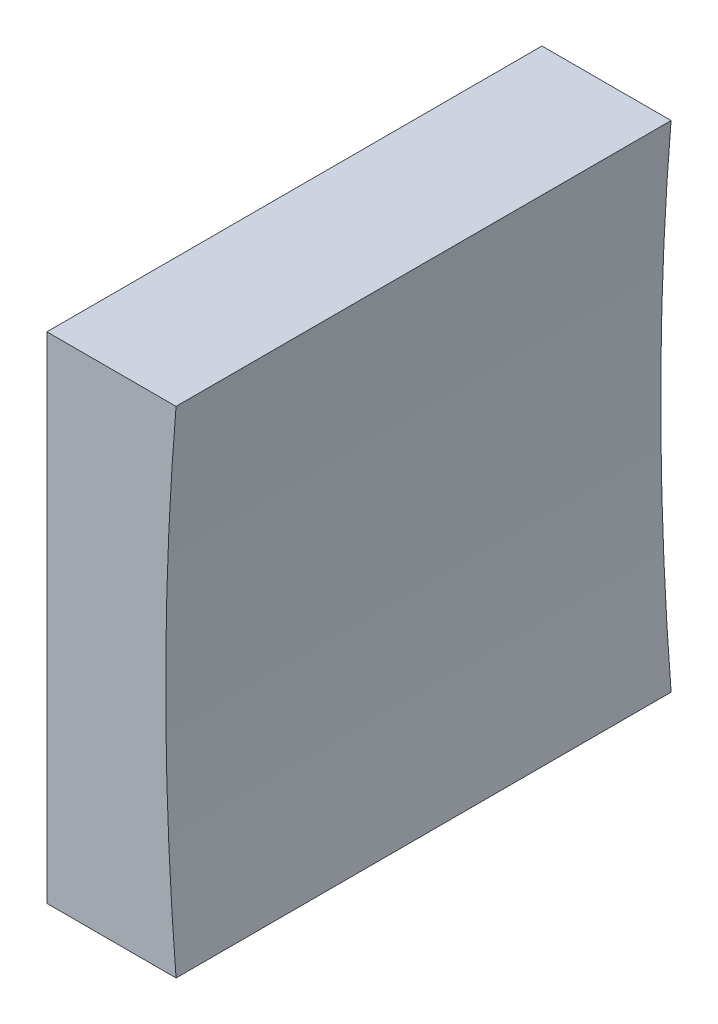
ISO-10303-21;
HEADER;
FILE_DESCRIPTION(('STEP AP214'),'2;1');
FILE_NAME('part.step','',(''),(''),'','','');
FILE_SCHEMA(('AUTOMOTIVE_DESIGN { 1 0 10303 214 1 1 1 1 }'));
ENDSEC;
DATA;
#1=APPLICATION_CONTEXT('core data for automotive mechanical design processes');
#2=APPLICATION_PROTOCOL_DEFINITION('international standard','automotive_design',2000,#1);
#3=PRODUCT_CONTEXT('',#1,'mechanical');
#4=PRODUCT('Part','Part','',(#3));
#5=PRODUCT_RELATED_PRODUCT_CATEGORY('part','',(#4));
#6=PRODUCT_DEFINITION_FORMATION('','',#4);
#7=PRODUCT_DEFINITION_CONTEXT('part definition',#1,'design');
#8=PRODUCT_DEFINITION('design','',#6,#7);
#9=PRODUCT_DEFINITION_SHAPE('','',#8);
#10=(LENGTH_UNIT() NAMED_UNIT(*) SI_UNIT(.MILLI.,.METRE.));
#11=(NAMED_UNIT(*) PLANE_ANGLE_UNIT() SI_UNIT($,.RADIAN.));
#12=(NAMED_UNIT(*) SI_UNIT($,.STERADIAN.) SOLID_ANGLE_UNIT());
#13=UNCERTAINTY_MEASURE_WITH_UNIT(LENGTH_MEASURE(1.E-05),#10,'distance_accuracy_value','');
#14=(GEOMETRIC_REPRESENTATION_CONTEXT(3) GLOBAL_UNCERTAINTY_ASSIGNED_CONTEXT((#13)) GLOBAL_UNIT_ASSIGNED_CONTEXT((#10,
#11,#12)) REPRESENTATION_CONTEXT('',''));
#15=CARTESIAN_POINT('',(0.,0.,0.));
#16=DIRECTION('',(0.,0.,1.));
#17=DIRECTION('',(1.,0.,0.));
#18=AXIS2_PLACEMENT_3D('',#15,#16,#17);
#19=CARTESIAN_POINT('',(291.228876342537,54.3579292677671,25.));
#20=DIRECTION('',(0.,1.,0.));
#21=DIRECTION('',(0.,0.,1.));
#22=AXIS2_PLACEMENT_3D('',#19,#20,#21);
#23=PLANE('',#22);
#24=DIRECTION('',(1.,0.,0.));
#25=VECTOR('',#24,1.);
#26=CARTESIAN_POINT('',(291.228876342537,54.3579292677671,0.));
#27=LINE('',#26,#25);
#28=CARTESIAN_POINT('',(284.707135631282,54.3579292677671,0.));
#29=VERTEX_POINT('',#28);
#30=CARTESIAN_POINT('',(291.228876342537,54.3579292677671,0.));
#31=VERTEX_POINT('',#30);
#32=EDGE_CURVE('E91',#29,#31,#27,.T.);
#33=ORIENTED_EDGE('',*,*,#32,.T.);
#34=DIRECTION('',(0.,0.,-1.));
#35=VECTOR('',#34,1.);
#36=CARTESIAN_POINT('',(291.228876342537,54.3579292677671,25.));
#37=LINE('',#36,#35);
#38=CARTESIAN_POINT('',(291.228876342537,54.3579292677671,25.));
#39=VERTEX_POINT('',#38);
#40=EDGE_CURVE('E45',#39,#31,#37,.T.);
#41=ORIENTED_EDGE('',*,*,#40,.F.);
#42=DIRECTION('',(1.,0.,0.));
#43=VECTOR('',#42,1.);
#44=CARTESIAN_POINT('',(291.228876342537,54.3579292677671,25.));
#45=LINE('',#44,#43);
#46=CARTESIAN_POINT('',(284.707135631282,54.3579292677671,25.));
#47=VERTEX_POINT('',#46);
#48=EDGE_CURVE('E84',#47,#39,#45,.T.);
#49=ORIENTED_EDGE('',*,*,#48,.F.);
#50=DIRECTION('',(0.,0.,-1.));
#51=VECTOR('',#50,1.);
#52=CARTESIAN_POINT('',(284.707135631282,54.3579292677671,25.));
#53=LINE('',#52,#51);
#54=EDGE_CURVE('E11',#47,#29,#53,.T.);
#55=ORIENTED_EDGE('',*,*,#54,.T.);
#56=EDGE_LOOP('',(#33,#41,#49,#55));
#57=FACE_BOUND('',#56,.T.);
#58=ADVANCED_FACE('F37',(#57),#23,.F.);
#59=CARTESIAN_POINT('',(440.707135631304,66.8579292677671,25.));
#60=DIRECTION('',(0.,0.,-1.));
#61=DIRECTION('',(-1.,0.,0.));
#62=AXIS2_PLACEMENT_3D('',#59,#60,#61);
#63=CYLINDRICAL_SURFACE('',#62,150.);
#64=CARTESIAN_POINT('',(440.707135631304,66.8579292677671,0.));
#65=DIRECTION('',(0.,0.,-1.));
#66=DIRECTION('',(1.,0.,0.));
#67=AXIS2_PLACEMENT_3D('',#64,#65,#66);
#68=CIRCLE('',#67,150.);
#69=CARTESIAN_POINT('',(291.228876342537,79.3579292677671,0.));
#70=VERTEX_POINT('',#69);
#71=EDGE_CURVE('E71',#31,#70,#68,.T.);
#72=ORIENTED_EDGE('',*,*,#71,.T.);
#73=DIRECTION('',(0.,0.,-1.));
#74=VECTOR('',#73,1.);
#75=CARTESIAN_POINT('',(291.228876342537,79.3579292677671,25.));
#76=LINE('',#75,#74);
#77=CARTESIAN_POINT('',(291.228876342537,79.3579292677671,25.));
#78=VERTEX_POINT('',#77);
#79=EDGE_CURVE('E92',#78,#70,#76,.T.);
#80=ORIENTED_EDGE('',*,*,#79,.F.);
#81=CARTESIAN_POINT('',(440.707135631304,66.8579292677671,25.));
#82=DIRECTION('',(0.,0.,-1.));
#83=DIRECTION('',(1.,0.,0.));
#84=AXIS2_PLACEMENT_3D('',#81,#82,#83);
#85=CIRCLE('',#84,150.);
#86=EDGE_CURVE('E88',#39,#78,#85,.T.);
#87=ORIENTED_EDGE('',*,*,#86,.F.);
#88=ORIENTED_EDGE('',*,*,#40,.T.);
#89=EDGE_LOOP('',(#72,#80,#87,#88));
#90=FACE_BOUND('',#89,.T.);
#91=ADVANCED_FACE('F93',(#90),#63,.F.);
#92=CARTESIAN_POINT('',(284.707135631282,79.3579292677671,25.));
#93=DIRECTION('',(0.,-1.,0.));
#94=DIRECTION('',(0.,0.,-1.));
#95=AXIS2_PLACEMENT_3D('',#92,#93,#94);
#96=PLANE('',#95);
#97=DIRECTION('',(-1.,0.,0.));
#98=VECTOR('',#97,1.);
#99=CARTESIAN_POINT('',(284.707135631282,79.3579292677671,0.));
#100=LINE('',#99,#98);
#101=CARTESIAN_POINT('',(284.707135631282,79.3579292677671,0.));
#102=VERTEX_POINT('',#101);
#103=EDGE_CURVE('E78',#70,#102,#100,.T.);
#104=ORIENTED_EDGE('',*,*,#103,.T.);
#105=DIRECTION('',(0.,0.,-1.));
#106=VECTOR('',#105,1.);
#107=CARTESIAN_POINT('',(284.707135631282,79.3579292677671,25.));
#108=LINE('',#107,#106);
#109=CARTESIAN_POINT('',(284.707135631282,79.3579292677671,25.));
#110=VERTEX_POINT('',#109);
#111=EDGE_CURVE('E97',#110,#102,#108,.T.);
#112=ORIENTED_EDGE('',*,*,#111,.F.);
#113=DIRECTION('',(-1.,0.,0.));
#114=VECTOR('',#113,1.);
#115=CARTESIAN_POINT('',(284.707135631282,79.3579292677671,25.));
#116=LINE('',#115,#114);
#117=EDGE_CURVE('E95',#78,#110,#116,.T.);
#118=ORIENTED_EDGE('',*,*,#117,.F.);
#119=ORIENTED_EDGE('',*,*,#79,.T.);
#120=EDGE_LOOP('',(#104,#112,#118,#119));
#121=FACE_BOUND('',#120,.T.);
#122=ADVANCED_FACE('F107',(#121),#96,.F.);
#123=CARTESIAN_POINT('',(284.707135631282,66.8579292677671,25.));
#124=DIRECTION('',(1.,0.,0.));
#125=DIRECTION('',(0.,0.,-1.));
#126=AXIS2_PLACEMENT_3D('',#123,#124,#125);
#127=PLANE('',#126);
#128=DIRECTION('',(0.,-1.,0.));
#129=VECTOR('',#128,1.);
#130=CARTESIAN_POINT('',(284.707135631282,66.8579292677671,0.));
#131=LINE('',#130,#129);
#132=EDGE_CURVE('E104',#102,#29,#131,.T.);
#133=ORIENTED_EDGE('',*,*,#132,.T.);
#134=ORIENTED_EDGE('',*,*,#54,.F.);
#135=DIRECTION('',(0.,-1.,0.));
#136=VECTOR('',#135,1.);
#137=CARTESIAN_POINT('',(284.707135631282,54.3579292677671,25.));
#138=LINE('',#137,#136);
#139=EDGE_CURVE('E53',#110,#47,#138,.T.);
#140=ORIENTED_EDGE('',*,*,#139,.F.);
#141=ORIENTED_EDGE('',*,*,#111,.T.);
#142=EDGE_LOOP('',(#133,#134,#140,#141));
#143=FACE_BOUND('',#142,.T.);
#144=ADVANCED_FACE('F111',(#143),#127,.F.);
#145=CARTESIAN_POINT('',(440.707135631304,66.8579292677671,25.));
#146=DIRECTION('',(0.,0.,1.));
#147=DIRECTION('',(1.,0.,0.));
#148=AXIS2_PLACEMENT_3D('',#145,#146,#147);
#149=PLANE('',#148);
#150=ORIENTED_EDGE('',*,*,#139,.T.);
#151=ORIENTED_EDGE('',*,*,#48,.T.);
#152=ORIENTED_EDGE('',*,*,#86,.T.);
#153=ORIENTED_EDGE('',*,*,#117,.T.);
#154=EDGE_LOOP('',(#150,#151,#152,#153));
#155=FACE_BOUND('',#154,.T.);
#156=ADVANCED_FACE('F86',(#155),#149,.T.);
#157=CARTESIAN_POINT('',(440.707135631304,66.8579292677671,0.));
#158=DIRECTION('',(0.,0.,1.));
#159=DIRECTION('',(1.,0.,0.));
#160=AXIS2_PLACEMENT_3D('',#157,#158,#159);
#161=PLANE('',#160);
#162=ORIENTED_EDGE('',*,*,#32,.F.);
#163=ORIENTED_EDGE('',*,*,#132,.F.);
#164=ORIENTED_EDGE('',*,*,#103,.F.);
#165=ORIENTED_EDGE('',*,*,#71,.F.);
#166=EDGE_LOOP('',(#162,#163,#164,#165));
#167=FACE_BOUND('',#166,.T.);
#168=ADVANCED_FACE('F110',(#167),#161,.F.);
#169=CLOSED_SHELL('',(#58,#91,#122,#144,#156,#168));
#170=MANIFOLD_SOLID_BREP('B2',#169);
#171=ADVANCED_BREP_SHAPE_REPRESENTATION('',(#18,#170),#14);
#172=SHAPE_DEFINITION_REPRESENTATION(#9,#171);
ENDSEC;
END-ISO-10303-21;
